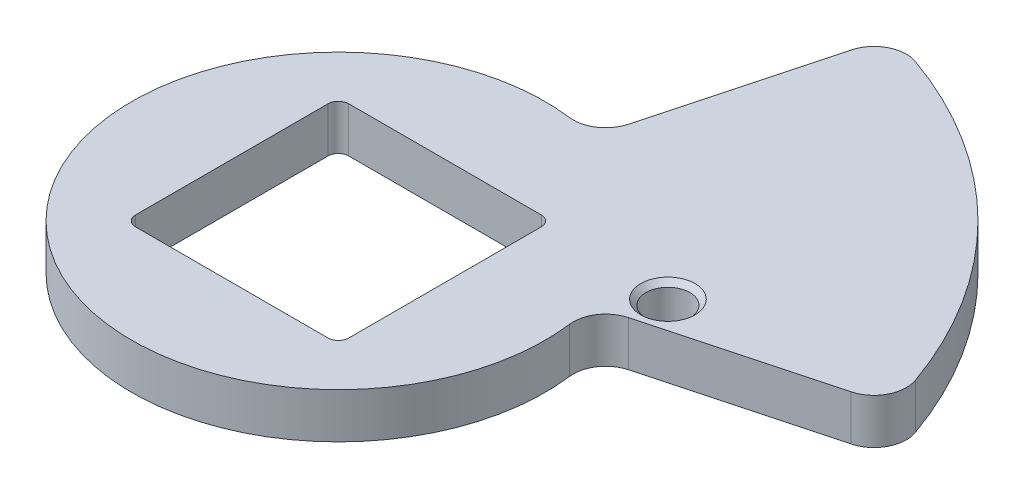
ISO-10303-21;
HEADER;
FILE_DESCRIPTION(('STEP AP214'),'2;1');
FILE_NAME('part.step','',(''),(''),'','','');
FILE_SCHEMA(('AUTOMOTIVE_DESIGN { 1 0 10303 214 1 1 1 1 }'));
ENDSEC;
DATA;
#1=APPLICATION_CONTEXT('core data for automotive mechanical design processes');
#2=APPLICATION_PROTOCOL_DEFINITION('international standard','automotive_design',2000,#1);
#3=PRODUCT_CONTEXT('',#1,'mechanical');
#4=PRODUCT('Part','Part','',(#3));
#5=PRODUCT_RELATED_PRODUCT_CATEGORY('part','',(#4));
#6=PRODUCT_DEFINITION_FORMATION('','',#4);
#7=PRODUCT_DEFINITION_CONTEXT('part definition',#1,'design');
#8=PRODUCT_DEFINITION('design','',#6,#7);
#9=PRODUCT_DEFINITION_SHAPE('','',#8);
#10=(LENGTH_UNIT() NAMED_UNIT(*) SI_UNIT(.MILLI.,.METRE.));
#11=(NAMED_UNIT(*) PLANE_ANGLE_UNIT() SI_UNIT($,.RADIAN.));
#12=(NAMED_UNIT(*) SI_UNIT($,.STERADIAN.) SOLID_ANGLE_UNIT());
#13=UNCERTAINTY_MEASURE_WITH_UNIT(LENGTH_MEASURE(1.E-05),#10,'distance_accuracy_value','');
#14=(GEOMETRIC_REPRESENTATION_CONTEXT(3) GLOBAL_UNCERTAINTY_ASSIGNED_CONTEXT((#13)) GLOBAL_UNIT_ASSIGNED_CONTEXT((#10,
#11,#12)) REPRESENTATION_CONTEXT('',''));
#15=CARTESIAN_POINT('',(0.,0.,0.));
#16=DIRECTION('',(0.,0.,1.));
#17=DIRECTION('',(1.,0.,0.));
#18=AXIS2_PLACEMENT_3D('',#15,#16,#17);
#19=CARTESIAN_POINT('',(23.3080057987872,4.445,-2.9583594581628));
#20=DIRECTION('',(0.,1.,0.));
#21=DIRECTION('',(0.,0.,1.));
#22=AXIS2_PLACEMENT_3D('',#19,#20,#21);
#23=PLANE('',#22);
#24=CARTESIAN_POINT('',(22.86,4.445,-9.525));
#25=DIRECTION('',(0.,1.,0.));
#26=DIRECTION('',(0.,0.,1.));
#27=AXIS2_PLACEMENT_3D('',#24,#25,#26);
#28=CIRCLE('',#27,2.667);
#29=CARTESIAN_POINT('',(22.86,4.445,-6.858));
#30=VERTEX_POINT('',#29);
#31=EDGE_CURVE('E11',#30,#30,#28,.F.);
#32=ORIENTED_EDGE('',*,*,#31,.T.);
#33=EDGE_LOOP('',(#32));
#34=FACE_BOUND('',#33,.T.);
#35=CARTESIAN_POINT('',(23.3080057987872,4.445,-2.9583594581628));
#36=DIRECTION('',(0.,-1.,0.));
#37=DIRECTION('',(0.,0.,1.));
#38=AXIS2_PLACEMENT_3D('',#35,#36,#37);
#39=CIRCLE('',#38,3.175);
#40=CARTESIAN_POINT('',(20.1582752854376,4.445,-2.55858115300566));
#41=VERTEX_POINT('',#40);
#42=CARTESIAN_POINT('',(22.4862553305867,4.445,-6.02517395663059));
#43=VERTEX_POINT('',#42);
#44=EDGE_CURVE('E245',#41,#43,#39,.T.);
#45=ORIENTED_EDGE('',*,*,#44,.T.);
#46=DIRECTION('',(0.96592582628907,0.,-0.258819045102515));
#47=VECTOR('',#46,1.);
#48=CARTESIAN_POINT('',(39.7504590693751,4.445,-10.6511034064052));
#49=LINE('',#48,#47);
#50=CARTESIAN_POINT('',(39.7504590693751,4.445,-10.6511034064052));
#51=VERTEX_POINT('',#50);
#52=EDGE_CURVE('E249',#43,#51,#49,.T.);
#53=ORIENTED_EDGE('',*,*,#52,.T.);
#54=CARTESIAN_POINT('',(38.9287086011746,4.445,-13.717917904873));
#55=DIRECTION('',(0.,1.,0.));
#56=DIRECTION('',(0.,0.,-1.));
#57=AXIS2_PLACEMENT_3D('',#54,#55,#56);
#58=CIRCLE('',#57,3.175);
#59=CARTESIAN_POINT('',(41.9232246474188,4.445,-14.773142359094));
#60=VERTEX_POINT('',#59);
#61=EDGE_CURVE('E253',#51,#60,#58,.T.);
#62=ORIENTED_EDGE('',*,*,#61,.T.);
#63=CARTESIAN_POINT('',(0.,4.445,0.));
#64=DIRECTION('',(0.,1.,0.));
#65=DIRECTION('',(0.,0.,-1.));
#66=AXIS2_PLACEMENT_3D('',#63,#64,#65);
#67=CIRCLE('',#66,44.45);
#68=CARTESIAN_POINT('',(14.7731423590938,4.445,-41.9232246474189));
#69=VERTEX_POINT('',#68);
#70=EDGE_CURVE('E256',#60,#69,#67,.T.);
#71=ORIENTED_EDGE('',*,*,#70,.T.);
#72=CARTESIAN_POINT('',(13.7179179048728,4.445,-38.9287086011746));
#73=DIRECTION('',(0.,1.,0.));
#74=DIRECTION('',(0.,0.,1.));
#75=AXIS2_PLACEMENT_3D('',#72,#73,#74);
#76=CIRCLE('',#75,3.175);
#77=CARTESIAN_POINT('',(10.651103406405,4.445,-39.7504590693751));
#78=VERTEX_POINT('',#77);
#79=EDGE_CURVE('E259',#69,#78,#76,.T.);
#80=ORIENTED_EDGE('',*,*,#79,.T.);
#81=DIRECTION('',(-0.258819045102511,0.,0.965925826289071));
#82=VECTOR('',#81,1.);
#83=CARTESIAN_POINT('',(10.651103406405,4.445,-39.7504590693751));
#84=LINE('',#83,#82);
#85=CARTESIAN_POINT('',(6.02517395663051,4.445,-22.4862553305868));
#86=VERTEX_POINT('',#85);
#87=EDGE_CURVE('E262',#78,#86,#84,.T.);
#88=ORIENTED_EDGE('',*,*,#87,.T.);
#89=CARTESIAN_POINT('',(2.95835945816271,4.445,-23.3080057987872));
#90=DIRECTION('',(0.,-1.,0.));
#91=DIRECTION('',(0.,0.,-1.));
#92=AXIS2_PLACEMENT_3D('',#89,#90,#91);
#93=CIRCLE('',#92,3.175);
#94=CARTESIAN_POINT('',(2.55858115300558,4.445,-20.1582752854376));
#95=VERTEX_POINT('',#94);
#96=EDGE_CURVE('E265',#86,#95,#93,.T.);
#97=ORIENTED_EDGE('',*,*,#96,.T.);
#98=CARTESIAN_POINT('',(0.,4.445,0.));
#99=DIRECTION('',(0.,1.,0.));
#100=DIRECTION('',(0.,0.,1.));
#101=AXIS2_PLACEMENT_3D('',#98,#99,#100);
#102=CIRCLE('',#101,20.32);
#103=EDGE_CURVE('E268',#95,#41,#102,.T.);
#104=ORIENTED_EDGE('',*,*,#103,.T.);
#105=EDGE_LOOP('',(#45,#53,#62,#71,#80,#88,#97,#104));
#106=FACE_BOUND('',#105,.T.);
#107=DIRECTION('',(1.,0.,0.));
#108=VECTOR('',#107,1.);
#109=CARTESIAN_POINT('',(-9.4615,4.445,10.4775));
#110=LINE('',#109,#108);
#111=CARTESIAN_POINT('',(-9.4615,4.445,10.4775));
#112=VERTEX_POINT('',#111);
#113=CARTESIAN_POINT('',(9.46149999999999,4.445,10.4775));
#114=VERTEX_POINT('',#113);
#115=EDGE_CURVE('E165',#112,#114,#110,.T.);
#116=ORIENTED_EDGE('',*,*,#115,.F.);
#117=CARTESIAN_POINT('',(-9.4615,4.445,9.4615));
#118=DIRECTION('',(0.,1.,0.));
#119=DIRECTION('',(0.,0.,-1.));
#120=AXIS2_PLACEMENT_3D('',#117,#118,#119);
#121=CIRCLE('',#120,1.016);
#122=CARTESIAN_POINT('',(-10.4775,4.445,9.46149999999999));
#123=VERTEX_POINT('',#122);
#124=EDGE_CURVE('E156',#123,#112,#121,.T.);
#125=ORIENTED_EDGE('',*,*,#124,.F.);
#126=DIRECTION('',(0.,0.,1.));
#127=VECTOR('',#126,1.);
#128=CARTESIAN_POINT('',(-10.4775,4.445,9.46149999999999));
#129=LINE('',#128,#127);
#130=CARTESIAN_POINT('',(-10.4775,4.445,-9.46149999999999));
#131=VERTEX_POINT('',#130);
#132=EDGE_CURVE('E197',#131,#123,#129,.T.);
#133=ORIENTED_EDGE('',*,*,#132,.F.);
#134=CARTESIAN_POINT('',(-9.4615,4.445,-9.4615));
#135=DIRECTION('',(0.,1.,0.));
#136=DIRECTION('',(0.,0.,-1.));
#137=AXIS2_PLACEMENT_3D('',#134,#135,#136);
#138=CIRCLE('',#137,1.016);
#139=CARTESIAN_POINT('',(-9.4615,4.445,-10.4775));
#140=VERTEX_POINT('',#139);
#141=EDGE_CURVE('E194',#140,#131,#138,.T.);
#142=ORIENTED_EDGE('',*,*,#141,.F.);
#143=DIRECTION('',(-1.,0.,0.));
#144=VECTOR('',#143,1.);
#145=CARTESIAN_POINT('',(-9.4615,4.445,-10.4775));
#146=LINE('',#145,#144);
#147=CARTESIAN_POINT('',(9.46149999999999,4.445,-10.4775));
#148=VERTEX_POINT('',#147);
#149=EDGE_CURVE('E191',#148,#140,#146,.T.);
#150=ORIENTED_EDGE('',*,*,#149,.F.);
#151=CARTESIAN_POINT('',(9.4615,4.445,-9.4615));
#152=DIRECTION('',(0.,1.,0.));
#153=DIRECTION('',(0.,0.,-1.));
#154=AXIS2_PLACEMENT_3D('',#151,#152,#153);
#155=CIRCLE('',#154,1.016);
#156=CARTESIAN_POINT('',(10.4775,4.445,-9.46149999999999));
#157=VERTEX_POINT('',#156);
#158=EDGE_CURVE('E188',#157,#148,#155,.T.);
#159=ORIENTED_EDGE('',*,*,#158,.F.);
#160=DIRECTION('',(0.,0.,-1.));
#161=VECTOR('',#160,1.);
#162=CARTESIAN_POINT('',(10.4775,4.445,9.46149999999999));
#163=LINE('',#162,#161);
#164=CARTESIAN_POINT('',(10.4775,4.445,9.46149999999999));
#165=VERTEX_POINT('',#164);
#166=EDGE_CURVE('E183',#165,#157,#163,.T.);
#167=ORIENTED_EDGE('',*,*,#166,.F.);
#168=CARTESIAN_POINT('',(9.4615,4.445,9.4615));
#169=DIRECTION('',(0.,1.,0.));
#170=DIRECTION('',(0.,0.,1.));
#171=AXIS2_PLACEMENT_3D('',#168,#169,#170);
#172=CIRCLE('',#171,1.016);
#173=EDGE_CURVE('E179',#114,#165,#172,.T.);
#174=ORIENTED_EDGE('',*,*,#173,.F.);
#175=EDGE_LOOP('',(#116,#125,#133,#142,#150,#159,#167,#174));
#176=FACE_BOUND('',#175,.T.);
#177=ADVANCED_FACE('F41',(#34,#106,#176),#23,.T.);
#178=CARTESIAN_POINT('',(23.3080057987872,0.,-2.9583594581628));
#179=DIRECTION('',(0.,1.,0.));
#180=DIRECTION('',(0.,0.,1.));
#181=AXIS2_PLACEMENT_3D('',#178,#179,#180);
#182=PLANE('',#181);
#183=CARTESIAN_POINT('',(22.86,0.,-9.525));
#184=DIRECTION('',(0.,1.,0.));
#185=DIRECTION('',(0.,0.,1.));
#186=AXIS2_PLACEMENT_3D('',#183,#184,#185);
#187=CIRCLE('',#186,2.667);
#188=CARTESIAN_POINT('',(22.86,0.,-6.858));
#189=VERTEX_POINT('',#188);
#190=EDGE_CURVE('E326',#189,#189,#187,.T.);
#191=ORIENTED_EDGE('',*,*,#190,.T.);
#192=EDGE_LOOP('',(#191));
#193=FACE_BOUND('',#192,.T.);
#194=CARTESIAN_POINT('',(23.3080057987872,0.,-2.9583594581628));
#195=DIRECTION('',(0.,-1.,0.));
#196=DIRECTION('',(0.,0.,1.));
#197=AXIS2_PLACEMENT_3D('',#194,#195,#196);
#198=CIRCLE('',#197,3.175);
#199=CARTESIAN_POINT('',(20.1582752854376,0.,-2.55858115300566));
#200=VERTEX_POINT('',#199);
#201=CARTESIAN_POINT('',(22.4862553305867,0.,-6.02517395663059));
#202=VERTEX_POINT('',#201);
#203=EDGE_CURVE('E174',#200,#202,#198,.T.);
#204=ORIENTED_EDGE('',*,*,#203,.F.);
#205=CARTESIAN_POINT('',(0.,0.,0.));
#206=DIRECTION('',(0.,1.,0.));
#207=DIRECTION('',(0.,0.,1.));
#208=AXIS2_PLACEMENT_3D('',#205,#206,#207);
#209=CIRCLE('',#208,20.32);
#210=CARTESIAN_POINT('',(2.55858115300558,0.,-20.1582752854376));
#211=VERTEX_POINT('',#210);
#212=EDGE_CURVE('E250',#211,#200,#209,.T.);
#213=ORIENTED_EDGE('',*,*,#212,.F.);
#214=CARTESIAN_POINT('',(2.95835945816271,0.,-23.3080057987872));
#215=DIRECTION('',(0.,-1.,0.));
#216=DIRECTION('',(0.,0.,-1.));
#217=AXIS2_PLACEMENT_3D('',#214,#215,#216);
#218=CIRCLE('',#217,3.175);
#219=CARTESIAN_POINT('',(6.02517395663051,0.,-22.4862553305868));
#220=VERTEX_POINT('',#219);
#221=EDGE_CURVE('E290',#220,#211,#218,.T.);
#222=ORIENTED_EDGE('',*,*,#221,.F.);
#223=DIRECTION('',(-0.258819045102511,0.,0.965925826289071));
#224=VECTOR('',#223,1.);
#225=CARTESIAN_POINT('',(10.651103406405,0.,-39.7504590693751));
#226=LINE('',#225,#224);
#227=CARTESIAN_POINT('',(10.651103406405,0.,-39.7504590693751));
#228=VERTEX_POINT('',#227);
#229=EDGE_CURVE('E287',#228,#220,#226,.T.);
#230=ORIENTED_EDGE('',*,*,#229,.F.);
#231=CARTESIAN_POINT('',(13.7179179048728,0.,-38.9287086011746));
#232=DIRECTION('',(0.,1.,0.));
#233=DIRECTION('',(0.,0.,1.));
#234=AXIS2_PLACEMENT_3D('',#231,#232,#233);
#235=CIRCLE('',#234,3.175);
#236=CARTESIAN_POINT('',(14.7731423590938,0.,-41.9232246474189));
#237=VERTEX_POINT('',#236);
#238=EDGE_CURVE('E284',#237,#228,#235,.T.);
#239=ORIENTED_EDGE('',*,*,#238,.F.);
#240=CARTESIAN_POINT('',(0.,0.,0.));
#241=DIRECTION('',(0.,1.,0.));
#242=DIRECTION('',(0.,0.,-1.));
#243=AXIS2_PLACEMENT_3D('',#240,#241,#242);
#244=CIRCLE('',#243,44.45);
#245=CARTESIAN_POINT('',(41.9232246474188,0.,-14.773142359094));
#246=VERTEX_POINT('',#245);
#247=EDGE_CURVE('E281',#246,#237,#244,.T.);
#248=ORIENTED_EDGE('',*,*,#247,.F.);
#249=CARTESIAN_POINT('',(38.9287086011746,0.,-13.717917904873));
#250=DIRECTION('',(0.,1.,0.));
#251=DIRECTION('',(0.,0.,-1.));
#252=AXIS2_PLACEMENT_3D('',#249,#250,#251);
#253=CIRCLE('',#252,3.175);
#254=CARTESIAN_POINT('',(39.7504590693751,0.,-10.6511034064052));
#255=VERTEX_POINT('',#254);
#256=EDGE_CURVE('E278',#255,#246,#253,.T.);
#257=ORIENTED_EDGE('',*,*,#256,.F.);
#258=DIRECTION('',(0.96592582628907,0.,-0.258819045102515));
#259=VECTOR('',#258,1.);
#260=CARTESIAN_POINT('',(39.7504590693751,0.,-10.6511034064052));
#261=LINE('',#260,#259);
#262=EDGE_CURVE('E275',#202,#255,#261,.T.);
#263=ORIENTED_EDGE('',*,*,#262,.F.);
#264=EDGE_LOOP('',(#204,#213,#222,#230,#239,#248,#257,#263));
#265=FACE_BOUND('',#264,.T.);
#266=CARTESIAN_POINT('',(-9.4615,0.,9.4615));
#267=DIRECTION('',(0.,1.,0.));
#268=DIRECTION('',(0.,0.,-1.));
#269=AXIS2_PLACEMENT_3D('',#266,#267,#268);
#270=CIRCLE('',#269,1.016);
#271=CARTESIAN_POINT('',(-10.4775,0.,9.46149999999999));
#272=VERTEX_POINT('',#271);
#273=CARTESIAN_POINT('',(-9.4615,0.,10.4775));
#274=VERTEX_POINT('',#273);
#275=EDGE_CURVE('E66',#272,#274,#270,.T.);
#276=ORIENTED_EDGE('',*,*,#275,.T.);
#277=DIRECTION('',(1.,0.,0.));
#278=VECTOR('',#277,1.);
#279=CARTESIAN_POINT('',(-9.4615,0.,10.4775));
#280=LINE('',#279,#278);
#281=CARTESIAN_POINT('',(9.46149999999999,0.,10.4775));
#282=VERTEX_POINT('',#281);
#283=EDGE_CURVE('E172',#274,#282,#280,.T.);
#284=ORIENTED_EDGE('',*,*,#283,.T.);
#285=CARTESIAN_POINT('',(9.4615,0.,9.4615));
#286=DIRECTION('',(0.,1.,0.));
#287=DIRECTION('',(0.,0.,1.));
#288=AXIS2_PLACEMENT_3D('',#285,#286,#287);
#289=CIRCLE('',#288,1.016);
#290=CARTESIAN_POINT('',(10.4775,0.,9.46149999999999));
#291=VERTEX_POINT('',#290);
#292=EDGE_CURVE('E204',#282,#291,#289,.T.);
#293=ORIENTED_EDGE('',*,*,#292,.T.);
#294=DIRECTION('',(0.,0.,-1.));
#295=VECTOR('',#294,1.);
#296=CARTESIAN_POINT('',(10.4775,0.,9.46149999999999));
#297=LINE('',#296,#295);
#298=CARTESIAN_POINT('',(10.4775,0.,-9.46149999999999));
#299=VERTEX_POINT('',#298);
#300=EDGE_CURVE('E208',#291,#299,#297,.T.);
#301=ORIENTED_EDGE('',*,*,#300,.T.);
#302=CARTESIAN_POINT('',(9.4615,0.,-9.4615));
#303=DIRECTION('',(0.,1.,0.));
#304=DIRECTION('',(0.,0.,-1.));
#305=AXIS2_PLACEMENT_3D('',#302,#303,#304);
#306=CIRCLE('',#305,1.016);
#307=CARTESIAN_POINT('',(9.46149999999999,0.,-10.4775));
#308=VERTEX_POINT('',#307);
#309=EDGE_CURVE('E212',#299,#308,#306,.T.);
#310=ORIENTED_EDGE('',*,*,#309,.T.);
#311=DIRECTION('',(-1.,0.,0.));
#312=VECTOR('',#311,1.);
#313=CARTESIAN_POINT('',(-9.4615,0.,-10.4775));
#314=LINE('',#313,#312);
#315=CARTESIAN_POINT('',(-9.4615,0.,-10.4775));
#316=VERTEX_POINT('',#315);
#317=EDGE_CURVE('E216',#308,#316,#314,.T.);
#318=ORIENTED_EDGE('',*,*,#317,.T.);
#319=CARTESIAN_POINT('',(-9.4615,0.,-9.4615));
#320=DIRECTION('',(0.,1.,0.));
#321=DIRECTION('',(0.,0.,-1.));
#322=AXIS2_PLACEMENT_3D('',#319,#320,#321);
#323=CIRCLE('',#322,1.016);
#324=CARTESIAN_POINT('',(-10.4775,0.,-9.46149999999999));
#325=VERTEX_POINT('',#324);
#326=EDGE_CURVE('E220',#316,#325,#323,.T.);
#327=ORIENTED_EDGE('',*,*,#326,.T.);
#328=DIRECTION('',(0.,0.,1.));
#329=VECTOR('',#328,1.);
#330=CARTESIAN_POINT('',(-10.4775,0.,9.46149999999999));
#331=LINE('',#330,#329);
#332=EDGE_CURVE('E166',#325,#272,#331,.T.);
#333=ORIENTED_EDGE('',*,*,#332,.T.);
#334=EDGE_LOOP('',(#276,#284,#293,#301,#310,#318,#327,#333));
#335=FACE_BOUND('',#334,.T.);
#336=ADVANCED_FACE('F346',(#193,#265,#335),#182,.F.);
#337=CARTESIAN_POINT('',(23.3080057987872,4.445,-2.9583594581628));
#338=DIRECTION('',(0.,-1.,0.));
#339=DIRECTION('',(0.,0.,-1.));
#340=AXIS2_PLACEMENT_3D('',#337,#338,#339);
#341=CYLINDRICAL_SURFACE('',#340,3.175);
#342=ORIENTED_EDGE('',*,*,#203,.T.);
#343=DIRECTION('',(0.,-1.,0.));
#344=VECTOR('',#343,1.);
#345=CARTESIAN_POINT('',(22.4862553305867,4.445,-6.02517395663059));
#346=LINE('',#345,#344);
#347=EDGE_CURVE('E322',#43,#202,#346,.T.);
#348=ORIENTED_EDGE('',*,*,#347,.F.);
#349=ORIENTED_EDGE('',*,*,#44,.F.);
#350=DIRECTION('',(0.,-1.,0.));
#351=VECTOR('',#350,1.);
#352=CARTESIAN_POINT('',(20.1582752854376,4.445,-2.55858115300566));
#353=LINE('',#352,#351);
#354=EDGE_CURVE('E271',#41,#200,#353,.T.);
#355=ORIENTED_EDGE('',*,*,#354,.T.);
#356=EDGE_LOOP('',(#342,#348,#349,#355));
#357=FACE_BOUND('',#356,.T.);
#358=ADVANCED_FACE('F349',(#357),#341,.F.);
#359=CARTESIAN_POINT('',(39.7504590693751,4.445,-10.6511034064052));
#360=DIRECTION('',(-0.258819045102515,0.,-0.96592582628907));
#361=DIRECTION('',(-0.96592582628907,0.,0.258819045102515));
#362=AXIS2_PLACEMENT_3D('',#359,#360,#361);
#363=PLANE('',#362);
#364=ORIENTED_EDGE('',*,*,#262,.T.);
#365=DIRECTION('',(0.,-1.,0.));
#366=VECTOR('',#365,1.);
#367=CARTESIAN_POINT('',(39.7504590693751,4.445,-10.6511034064052));
#368=LINE('',#367,#366);
#369=EDGE_CURVE('E318',#51,#255,#368,.T.);
#370=ORIENTED_EDGE('',*,*,#369,.F.);
#371=ORIENTED_EDGE('',*,*,#52,.F.);
#372=ORIENTED_EDGE('',*,*,#347,.T.);
#373=EDGE_LOOP('',(#364,#370,#371,#372));
#374=FACE_BOUND('',#373,.T.);
#375=ADVANCED_FACE('F416',(#374),#363,.F.);
#376=CARTESIAN_POINT('',(38.9287086011746,4.445,-13.717917904873));
#377=DIRECTION('',(0.,-1.,0.));
#378=DIRECTION('',(0.,0.,-1.));
#379=AXIS2_PLACEMENT_3D('',#376,#377,#378);
#380=CYLINDRICAL_SURFACE('',#379,3.175);
#381=ORIENTED_EDGE('',*,*,#256,.T.);
#382=DIRECTION('',(0.,-1.,0.));
#383=VECTOR('',#382,1.);
#384=CARTESIAN_POINT('',(41.9232246474188,4.445,-14.773142359094));
#385=LINE('',#384,#383);
#386=EDGE_CURVE('E314',#60,#246,#385,.T.);
#387=ORIENTED_EDGE('',*,*,#386,.F.);
#388=ORIENTED_EDGE('',*,*,#61,.F.);
#389=ORIENTED_EDGE('',*,*,#369,.T.);
#390=EDGE_LOOP('',(#381,#387,#388,#389));
#391=FACE_BOUND('',#390,.T.);
#392=ADVANCED_FACE('F412',(#391),#380,.T.);
#393=CARTESIAN_POINT('',(0.,4.445,0.));
#394=DIRECTION('',(0.,-1.,0.));
#395=DIRECTION('',(0.,0.,-1.));
#396=AXIS2_PLACEMENT_3D('',#393,#394,#395);
#397=CYLINDRICAL_SURFACE('',#396,44.45);
#398=ORIENTED_EDGE('',*,*,#247,.T.);
#399=DIRECTION('',(0.,-1.,0.));
#400=VECTOR('',#399,1.);
#401=CARTESIAN_POINT('',(14.7731423590938,4.445,-41.9232246474189));
#402=LINE('',#401,#400);
#403=EDGE_CURVE('E310',#69,#237,#402,.T.);
#404=ORIENTED_EDGE('',*,*,#403,.F.);
#405=ORIENTED_EDGE('',*,*,#70,.F.);
#406=ORIENTED_EDGE('',*,*,#386,.T.);
#407=EDGE_LOOP('',(#398,#404,#405,#406));
#408=FACE_BOUND('',#407,.T.);
#409=ADVANCED_FACE('F408',(#408),#397,.T.);
#410=CARTESIAN_POINT('',(13.7179179048728,4.445,-38.9287086011746));
#411=DIRECTION('',(0.,-1.,0.));
#412=DIRECTION('',(0.,0.,-1.));
#413=AXIS2_PLACEMENT_3D('',#410,#411,#412);
#414=CYLINDRICAL_SURFACE('',#413,3.175);
#415=ORIENTED_EDGE('',*,*,#238,.T.);
#416=DIRECTION('',(0.,-1.,0.));
#417=VECTOR('',#416,1.);
#418=CARTESIAN_POINT('',(10.651103406405,4.445,-39.7504590693751));
#419=LINE('',#418,#417);
#420=EDGE_CURVE('E306',#78,#228,#419,.T.);
#421=ORIENTED_EDGE('',*,*,#420,.F.);
#422=ORIENTED_EDGE('',*,*,#79,.F.);
#423=ORIENTED_EDGE('',*,*,#403,.T.);
#424=EDGE_LOOP('',(#415,#421,#422,#423));
#425=FACE_BOUND('',#424,.T.);
#426=ADVANCED_FACE('F404',(#425),#414,.T.);
#427=CARTESIAN_POINT('',(10.651103406405,4.445,-39.7504590693751));
#428=DIRECTION('',(0.965925826289071,0.,0.258819045102511));
#429=DIRECTION('',(0.258819045102511,0.,-0.965925826289071));
#430=AXIS2_PLACEMENT_3D('',#427,#428,#429);
#431=PLANE('',#430);
#432=ORIENTED_EDGE('',*,*,#229,.T.);
#433=DIRECTION('',(0.,-1.,0.));
#434=VECTOR('',#433,1.);
#435=CARTESIAN_POINT('',(6.02517395663051,4.445,-22.4862553305868));
#436=LINE('',#435,#434);
#437=EDGE_CURVE('E302',#86,#220,#436,.T.);
#438=ORIENTED_EDGE('',*,*,#437,.F.);
#439=ORIENTED_EDGE('',*,*,#87,.F.);
#440=ORIENTED_EDGE('',*,*,#420,.T.);
#441=EDGE_LOOP('',(#432,#438,#439,#440));
#442=FACE_BOUND('',#441,.T.);
#443=ADVANCED_FACE('F400',(#442),#431,.F.);
#444=CARTESIAN_POINT('',(2.95835945816271,4.445,-23.3080057987872));
#445=DIRECTION('',(0.,-1.,0.));
#446=DIRECTION('',(0.,0.,-1.));
#447=AXIS2_PLACEMENT_3D('',#444,#445,#446);
#448=CYLINDRICAL_SURFACE('',#447,3.175);
#449=ORIENTED_EDGE('',*,*,#221,.T.);
#450=DIRECTION('',(0.,-1.,0.));
#451=VECTOR('',#450,1.);
#452=CARTESIAN_POINT('',(2.55858115300558,4.445,-20.1582752854376));
#453=LINE('',#452,#451);
#454=EDGE_CURVE('E298',#95,#211,#453,.T.);
#455=ORIENTED_EDGE('',*,*,#454,.F.);
#456=ORIENTED_EDGE('',*,*,#96,.F.);
#457=ORIENTED_EDGE('',*,*,#437,.T.);
#458=EDGE_LOOP('',(#449,#455,#456,#457));
#459=FACE_BOUND('',#458,.T.);
#460=ADVANCED_FACE('F396',(#459),#448,.F.);
#461=CARTESIAN_POINT('',(0.,4.445,0.));
#462=DIRECTION('',(0.,-1.,0.));
#463=DIRECTION('',(0.,0.,-1.));
#464=AXIS2_PLACEMENT_3D('',#461,#462,#463);
#465=CYLINDRICAL_SURFACE('',#464,20.32);
#466=ORIENTED_EDGE('',*,*,#212,.T.);
#467=ORIENTED_EDGE('',*,*,#354,.F.);
#468=ORIENTED_EDGE('',*,*,#103,.F.);
#469=ORIENTED_EDGE('',*,*,#454,.T.);
#470=EDGE_LOOP('',(#466,#467,#468,#469));
#471=FACE_BOUND('',#470,.T.);
#472=ADVANCED_FACE('F393',(#471),#465,.T.);
#473=CARTESIAN_POINT('',(22.86,4.445,-9.525));
#474=DIRECTION('',(0.,-1.,0.));
#475=DIRECTION('',(0.,0.,-1.));
#476=AXIS2_PLACEMENT_3D('',#473,#474,#475);
#477=CYLINDRICAL_SURFACE('',#476,2.159);
#478=CARTESIAN_POINT('',(22.86,0.507999999999994,-9.525));
#479=DIRECTION('',(0.,1.,0.));
#480=DIRECTION('',(0.,0.,1.));
#481=AXIS2_PLACEMENT_3D('',#478,#479,#480);
#482=CIRCLE('',#481,2.159);
#483=CARTESIAN_POINT('',(22.86,0.507999999999994,-7.366));
#484=VERTEX_POINT('',#483);
#485=EDGE_CURVE('E51',#484,#484,#482,.F.);
#486=ORIENTED_EDGE('',*,*,#485,.T.);
#487=EDGE_LOOP('',(#486));
#488=FACE_BOUND('',#487,.T.);
#489=CARTESIAN_POINT('',(22.86,3.937,-9.525));
#490=DIRECTION('',(0.,1.,0.));
#491=DIRECTION('',(0.,0.,1.));
#492=AXIS2_PLACEMENT_3D('',#489,#490,#491);
#493=CIRCLE('',#492,2.159);
#494=CARTESIAN_POINT('',(22.86,3.937,-7.366));
#495=VERTEX_POINT('',#494);
#496=EDGE_CURVE('E330',#495,#495,#493,.T.);
#497=ORIENTED_EDGE('',*,*,#496,.T.);
#498=EDGE_LOOP('',(#497));
#499=FACE_BOUND('',#498,.T.);
#500=ADVANCED_FACE('F337',(#488,#499),#477,.F.);
#501=CARTESIAN_POINT('',(-9.4615,4.445,9.4615));
#502=DIRECTION('',(0.,-1.,0.));
#503=DIRECTION('',(0.,0.,-1.));
#504=AXIS2_PLACEMENT_3D('',#501,#502,#503);
#505=CYLINDRICAL_SURFACE('',#504,1.016);
#506=ORIENTED_EDGE('',*,*,#275,.F.);
#507=DIRECTION('',(0.,-1.,0.));
#508=VECTOR('',#507,1.);
#509=CARTESIAN_POINT('',(-10.4775,4.445,9.46149999999999));
#510=LINE('',#509,#508);
#511=EDGE_CURVE('E160',#123,#272,#510,.T.);
#512=ORIENTED_EDGE('',*,*,#511,.F.);
#513=ORIENTED_EDGE('',*,*,#124,.T.);
#514=DIRECTION('',(0.,-1.,0.));
#515=VECTOR('',#514,1.);
#516=CARTESIAN_POINT('',(-9.4615,4.445,10.4775));
#517=LINE('',#516,#515);
#518=EDGE_CURVE('E159',#112,#274,#517,.T.);
#519=ORIENTED_EDGE('',*,*,#518,.T.);
#520=EDGE_LOOP('',(#506,#512,#513,#519));
#521=FACE_BOUND('',#520,.T.);
#522=ADVANCED_FACE('F158',(#521),#505,.F.);
#523=CARTESIAN_POINT('',(-9.4615,4.445,10.4775));
#524=DIRECTION('',(0.,0.,-1.));
#525=DIRECTION('',(-1.,0.,0.));
#526=AXIS2_PLACEMENT_3D('',#523,#524,#525);
#527=PLANE('',#526);
#528=ORIENTED_EDGE('',*,*,#283,.F.);
#529=ORIENTED_EDGE('',*,*,#518,.F.);
#530=ORIENTED_EDGE('',*,*,#115,.T.);
#531=DIRECTION('',(0.,-1.,0.));
#532=VECTOR('',#531,1.);
#533=CARTESIAN_POINT('',(9.46149999999999,4.445,10.4775));
#534=LINE('',#533,#532);
#535=EDGE_CURVE('E175',#114,#282,#534,.T.);
#536=ORIENTED_EDGE('',*,*,#535,.T.);
#537=EDGE_LOOP('',(#528,#529,#530,#536));
#538=FACE_BOUND('',#537,.T.);
#539=ADVANCED_FACE('F169',(#538),#527,.T.);
#540=CARTESIAN_POINT('',(9.4615,4.445,9.4615));
#541=DIRECTION('',(0.,-1.,0.));
#542=DIRECTION('',(0.,0.,-1.));
#543=AXIS2_PLACEMENT_3D('',#540,#541,#542);
#544=CYLINDRICAL_SURFACE('',#543,1.016);
#545=ORIENTED_EDGE('',*,*,#292,.F.);
#546=ORIENTED_EDGE('',*,*,#535,.F.);
#547=ORIENTED_EDGE('',*,*,#173,.T.);
#548=DIRECTION('',(0.,-1.,0.));
#549=VECTOR('',#548,1.);
#550=CARTESIAN_POINT('',(10.4775,4.445,9.46149999999999));
#551=LINE('',#550,#549);
#552=EDGE_CURVE('E240',#165,#291,#551,.T.);
#553=ORIENTED_EDGE('',*,*,#552,.T.);
#554=EDGE_LOOP('',(#545,#546,#547,#553));
#555=FACE_BOUND('',#554,.T.);
#556=ADVANCED_FACE('F375',(#555),#544,.F.);
#557=CARTESIAN_POINT('',(10.4775,4.445,9.46149999999999));
#558=DIRECTION('',(-1.,0.,0.));
#559=DIRECTION('',(0.,0.,1.));
#560=AXIS2_PLACEMENT_3D('',#557,#558,#559);
#561=PLANE('',#560);
#562=ORIENTED_EDGE('',*,*,#300,.F.);
#563=ORIENTED_EDGE('',*,*,#552,.F.);
#564=ORIENTED_EDGE('',*,*,#166,.T.);
#565=DIRECTION('',(0.,-1.,0.));
#566=VECTOR('',#565,1.);
#567=CARTESIAN_POINT('',(10.4775,4.445,-9.46149999999999));
#568=LINE('',#567,#566);
#569=EDGE_CURVE('E237',#157,#299,#568,.T.);
#570=ORIENTED_EDGE('',*,*,#569,.T.);
#571=EDGE_LOOP('',(#562,#563,#564,#570));
#572=FACE_BOUND('',#571,.T.);
#573=ADVANCED_FACE('F372',(#572),#561,.T.);
#574=CARTESIAN_POINT('',(9.4615,4.445,-9.4615));
#575=DIRECTION('',(0.,-1.,0.));
#576=DIRECTION('',(0.,0.,-1.));
#577=AXIS2_PLACEMENT_3D('',#574,#575,#576);
#578=CYLINDRICAL_SURFACE('',#577,1.016);
#579=ORIENTED_EDGE('',*,*,#309,.F.);
#580=ORIENTED_EDGE('',*,*,#569,.F.);
#581=ORIENTED_EDGE('',*,*,#158,.T.);
#582=DIRECTION('',(0.,-1.,0.));
#583=VECTOR('',#582,1.);
#584=CARTESIAN_POINT('',(9.46149999999999,4.445,-10.4775));
#585=LINE('',#584,#583);
#586=EDGE_CURVE('E234',#148,#308,#585,.T.);
#587=ORIENTED_EDGE('',*,*,#586,.T.);
#588=EDGE_LOOP('',(#579,#580,#581,#587));
#589=FACE_BOUND('',#588,.T.);
#590=ADVANCED_FACE('F367',(#589),#578,.F.);
#591=CARTESIAN_POINT('',(-9.4615,4.445,-10.4775));
#592=DIRECTION('',(0.,0.,1.));
#593=DIRECTION('',(1.,0.,0.));
#594=AXIS2_PLACEMENT_3D('',#591,#592,#593);
#595=PLANE('',#594);
#596=ORIENTED_EDGE('',*,*,#317,.F.);
#597=ORIENTED_EDGE('',*,*,#586,.F.);
#598=ORIENTED_EDGE('',*,*,#149,.T.);
#599=DIRECTION('',(0.,-1.,0.));
#600=VECTOR('',#599,1.);
#601=CARTESIAN_POINT('',(-9.4615,4.445,-10.4775));
#602=LINE('',#601,#600);
#603=EDGE_CURVE('E231',#140,#316,#602,.T.);
#604=ORIENTED_EDGE('',*,*,#603,.T.);
#605=EDGE_LOOP('',(#596,#597,#598,#604));
#606=FACE_BOUND('',#605,.T.);
#607=ADVANCED_FACE('F363',(#606),#595,.T.);
#608=CARTESIAN_POINT('',(-9.4615,4.445,-9.4615));
#609=DIRECTION('',(0.,-1.,0.));
#610=DIRECTION('',(0.,0.,-1.));
#611=AXIS2_PLACEMENT_3D('',#608,#609,#610);
#612=CYLINDRICAL_SURFACE('',#611,1.016);
#613=ORIENTED_EDGE('',*,*,#326,.F.);
#614=ORIENTED_EDGE('',*,*,#603,.F.);
#615=ORIENTED_EDGE('',*,*,#141,.T.);
#616=DIRECTION('',(0.,-1.,0.));
#617=VECTOR('',#616,1.);
#618=CARTESIAN_POINT('',(-10.4775,4.445,-9.46149999999999));
#619=LINE('',#618,#617);
#620=EDGE_CURVE('E58',#131,#325,#619,.T.);
#621=ORIENTED_EDGE('',*,*,#620,.T.);
#622=EDGE_LOOP('',(#613,#614,#615,#621));
#623=FACE_BOUND('',#622,.T.);
#624=ADVANCED_FACE('F360',(#623),#612,.F.);
#625=CARTESIAN_POINT('',(-10.4775,4.445,9.46149999999999));
#626=DIRECTION('',(1.,0.,0.));
#627=DIRECTION('',(0.,0.,-1.));
#628=AXIS2_PLACEMENT_3D('',#625,#626,#627);
#629=PLANE('',#628);
#630=ORIENTED_EDGE('',*,*,#332,.F.);
#631=ORIENTED_EDGE('',*,*,#620,.F.);
#632=ORIENTED_EDGE('',*,*,#132,.T.);
#633=ORIENTED_EDGE('',*,*,#511,.T.);
#634=EDGE_LOOP('',(#630,#631,#632,#633));
#635=FACE_BOUND('',#634,.T.);
#636=ADVANCED_FACE('F343',(#635),#629,.T.);
#637=CARTESIAN_POINT('',(22.86,0.,-9.525));
#638=DIRECTION('',(0.,-1.,0.));
#639=DIRECTION('',(0.,0.,-1.));
#640=AXIS2_PLACEMENT_3D('',#637,#638,#639);
#641=CONICAL_SURFACE('',#640,2.667,0.785398163397456);
#642=ORIENTED_EDGE('',*,*,#485,.F.);
#643=EDGE_LOOP('',(#642));
#644=FACE_BOUND('',#643,.T.);
#645=ORIENTED_EDGE('',*,*,#190,.F.);
#646=EDGE_LOOP('',(#645));
#647=FACE_BOUND('',#646,.T.);
#648=ADVANCED_FACE('F340',(#644,#647),#641,.F.);
#649=CARTESIAN_POINT('',(22.86,3.937,-9.525));
#650=DIRECTION('',(0.,1.,0.));
#651=DIRECTION('',(0.,0.,1.));
#652=AXIS2_PLACEMENT_3D('',#649,#650,#651);
#653=CONICAL_SURFACE('',#652,2.159,0.785398163397454);
#654=ORIENTED_EDGE('',*,*,#31,.F.);
#655=EDGE_LOOP('',(#654));
#656=FACE_BOUND('',#655,.T.);
#657=ORIENTED_EDGE('',*,*,#496,.F.);
#658=EDGE_LOOP('',(#657));
#659=FACE_BOUND('',#658,.T.);
#660=ADVANCED_FACE('F44',(#656,#659),#653,.F.);
#661=CLOSED_SHELL('',(#177,#336,#358,#375,#392,#409,#426,#443,#460,#472,#500,#522,#539,#556,
#573,#590,#607,#624,#636,#648,#660));
#662=MANIFOLD_SOLID_BREP('B2',#661);
#663=ADVANCED_BREP_SHAPE_REPRESENTATION('',(#18,#662),#14);
#664=SHAPE_DEFINITION_REPRESENTATION(#9,#663);
ENDSEC;
END-ISO-10303-21;
